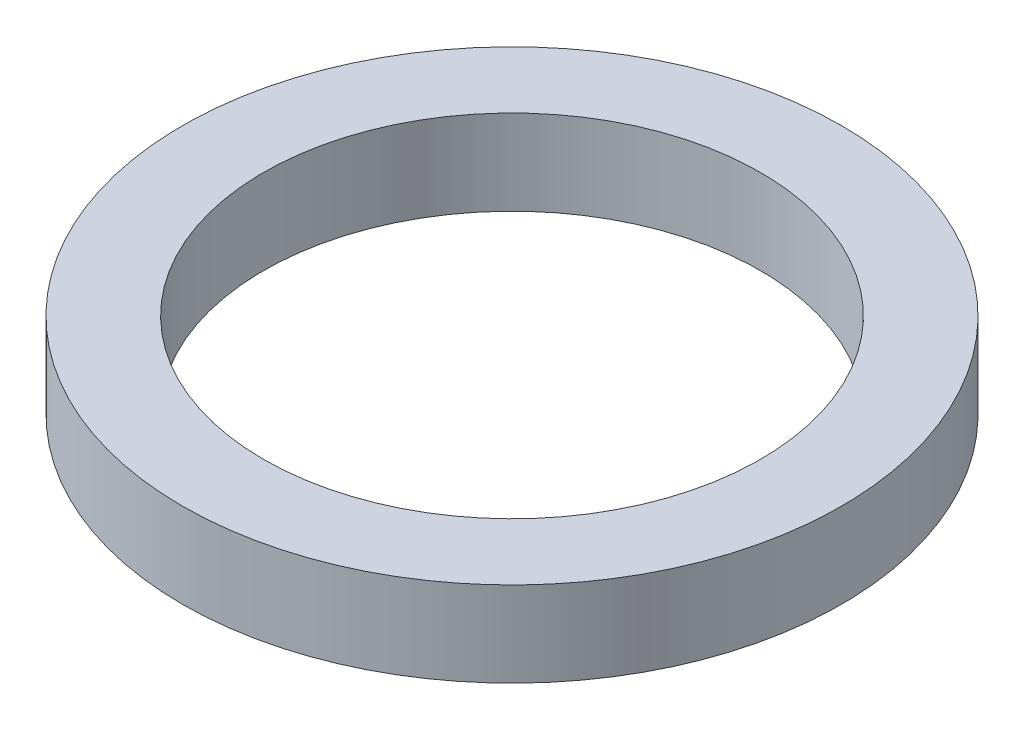
ISO-10303-21;
HEADER;
FILE_DESCRIPTION(('STEP AP214'),'2;1');
FILE_NAME('part.step','',(''),(''),'','','');
FILE_SCHEMA(('AUTOMOTIVE_DESIGN { 1 0 10303 214 1 1 1 1 }'));
ENDSEC;
DATA;
#1=APPLICATION_CONTEXT('core data for automotive mechanical design processes');
#2=APPLICATION_PROTOCOL_DEFINITION('international standard','automotive_design',2000,#1);
#3=PRODUCT_CONTEXT('',#1,'mechanical');
#4=PRODUCT('Part','Part','',(#3));
#5=PRODUCT_RELATED_PRODUCT_CATEGORY('part','',(#4));
#6=PRODUCT_DEFINITION_FORMATION('','',#4);
#7=PRODUCT_DEFINITION_CONTEXT('part definition',#1,'design');
#8=PRODUCT_DEFINITION('design','',#6,#7);
#9=PRODUCT_DEFINITION_SHAPE('','',#8);
#10=(LENGTH_UNIT() NAMED_UNIT(*) SI_UNIT(.MILLI.,.METRE.));
#11=(NAMED_UNIT(*) PLANE_ANGLE_UNIT() SI_UNIT($,.RADIAN.));
#12=(NAMED_UNIT(*) SI_UNIT($,.STERADIAN.) SOLID_ANGLE_UNIT());
#13=UNCERTAINTY_MEASURE_WITH_UNIT(LENGTH_MEASURE(1.E-05),#10,'distance_accuracy_value','');
#14=(GEOMETRIC_REPRESENTATION_CONTEXT(3) GLOBAL_UNCERTAINTY_ASSIGNED_CONTEXT((#13)) GLOBAL_UNIT_ASSIGNED_CONTEXT((#10,
#11,#12)) REPRESENTATION_CONTEXT('',''));
#15=CARTESIAN_POINT('',(0.,0.,0.));
#16=DIRECTION('',(0.,0.,1.));
#17=DIRECTION('',(1.,0.,0.));
#18=AXIS2_PLACEMENT_3D('',#15,#16,#17);
#19=CARTESIAN_POINT('',(0.,0.8128,0.));
#20=DIRECTION('',(0.,1.,0.));
#21=DIRECTION('',(0.,0.,1.));
#22=AXIS2_PLACEMENT_3D('',#19,#20,#21);
#23=PLANE('',#22);
#24=CARTESIAN_POINT('',(0.,0.8128,0.));
#25=DIRECTION('',(0.,1.,0.));
#26=DIRECTION('',(0.,0.,1.));
#27=AXIS2_PLACEMENT_3D('',#24,#25,#26);
#28=CIRCLE('',#27,3.1496);
#29=CARTESIAN_POINT('',(0.,0.8128,3.1496));
#30=VERTEX_POINT('',#29);
#31=EDGE_CURVE('E10',#30,#30,#28,.T.);
#32=ORIENTED_EDGE('',*,*,#31,.T.);
#33=EDGE_LOOP('',(#32));
#34=FACE_BOUND('',#33,.T.);
#35=CARTESIAN_POINT('',(0.,0.8128,0.));
#36=DIRECTION('',(0.,1.,0.));
#37=DIRECTION('',(0.,0.,1.));
#38=AXIS2_PLACEMENT_3D('',#35,#36,#37);
#39=CIRCLE('',#38,2.3749);
#40=CARTESIAN_POINT('',(0.,0.8128,2.3749));
#41=VERTEX_POINT('',#40);
#42=EDGE_CURVE('E42',#41,#41,#39,.T.);
#43=ORIENTED_EDGE('',*,*,#42,.F.);
#44=EDGE_LOOP('',(#43));
#45=FACE_BOUND('',#44,.T.);
#46=ADVANCED_FACE('F31',(#34,#45),#23,.T.);
#47=CARTESIAN_POINT('',(0.,0.,0.));
#48=DIRECTION('',(0.,1.,0.));
#49=DIRECTION('',(0.,0.,1.));
#50=AXIS2_PLACEMENT_3D('',#47,#48,#49);
#51=PLANE('',#50);
#52=CARTESIAN_POINT('',(0.,0.,0.));
#53=DIRECTION('',(0.,1.,0.));
#54=DIRECTION('',(0.,0.,1.));
#55=AXIS2_PLACEMENT_3D('',#52,#53,#54);
#56=CIRCLE('',#55,3.1496);
#57=CARTESIAN_POINT('',(0.,0.,3.1496));
#58=VERTEX_POINT('',#57);
#59=EDGE_CURVE('E35',#58,#58,#56,.T.);
#60=ORIENTED_EDGE('',*,*,#59,.F.);
#61=EDGE_LOOP('',(#60));
#62=FACE_BOUND('',#61,.T.);
#63=CARTESIAN_POINT('',(0.,0.,0.));
#64=DIRECTION('',(0.,1.,0.));
#65=DIRECTION('',(0.,0.,1.));
#66=AXIS2_PLACEMENT_3D('',#63,#64,#65);
#67=CIRCLE('',#66,2.3749);
#68=CARTESIAN_POINT('',(0.,0.,2.3749));
#69=VERTEX_POINT('',#68);
#70=EDGE_CURVE('E44',#69,#69,#67,.T.);
#71=ORIENTED_EDGE('',*,*,#70,.T.);
#72=EDGE_LOOP('',(#71));
#73=FACE_BOUND('',#72,.T.);
#74=ADVANCED_FACE('F54',(#62,#73),#51,.F.);
#75=CARTESIAN_POINT('',(0.,0.8128,0.));
#76=DIRECTION('',(0.,-1.,0.));
#77=DIRECTION('',(0.,0.,-1.));
#78=AXIS2_PLACEMENT_3D('',#75,#76,#77);
#79=CYLINDRICAL_SURFACE('',#78,3.1496);
#80=ORIENTED_EDGE('',*,*,#31,.F.);
#81=EDGE_LOOP('',(#80));
#82=FACE_BOUND('',#81,.T.);
#83=ORIENTED_EDGE('',*,*,#59,.T.);
#84=EDGE_LOOP('',(#83));
#85=FACE_BOUND('',#84,.T.);
#86=ADVANCED_FACE('F33',(#82,#85),#79,.T.);
#87=CARTESIAN_POINT('',(0.,0.8128,0.));
#88=DIRECTION('',(0.,-1.,0.));
#89=DIRECTION('',(0.,0.,-1.));
#90=AXIS2_PLACEMENT_3D('',#87,#88,#89);
#91=CYLINDRICAL_SURFACE('',#90,2.3749);
#92=ORIENTED_EDGE('',*,*,#42,.T.);
#93=EDGE_LOOP('',(#92));
#94=FACE_BOUND('',#93,.T.);
#95=ORIENTED_EDGE('',*,*,#70,.F.);
#96=EDGE_LOOP('',(#95));
#97=FACE_BOUND('',#96,.T.);
#98=ADVANCED_FACE('F50',(#94,#97),#91,.F.);
#99=CLOSED_SHELL('',(#46,#74,#86,#98));
#100=MANIFOLD_SOLID_BREP('B2',#99);
#101=ADVANCED_BREP_SHAPE_REPRESENTATION('',(#18,#100),#14);
#102=SHAPE_DEFINITION_REPRESENTATION(#9,#101);
ENDSEC;
END-ISO-10303-21;
